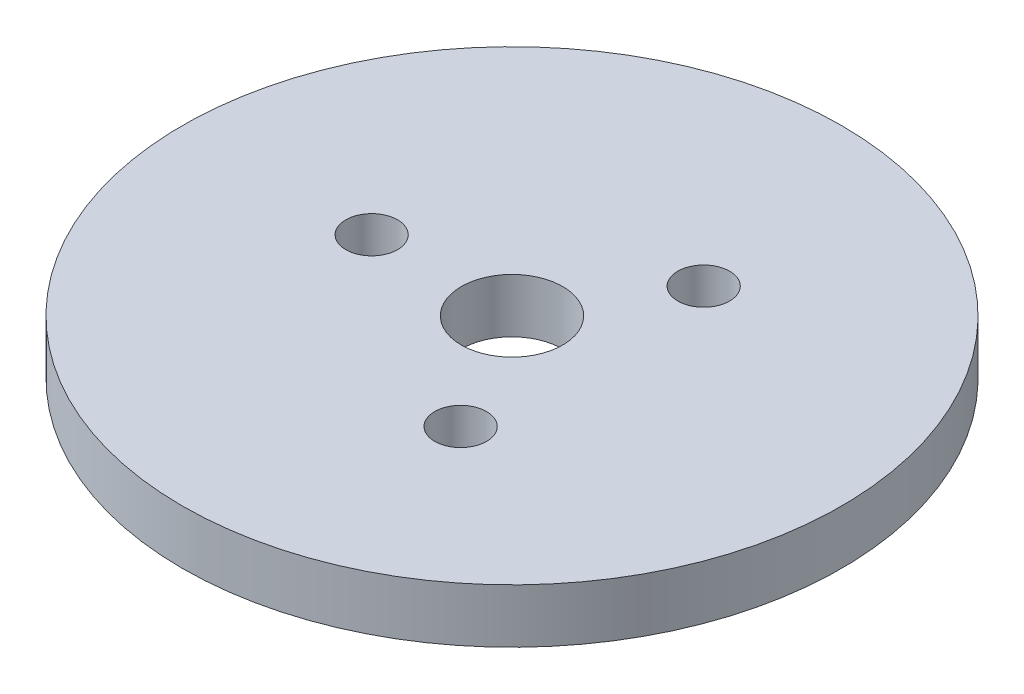
ISO-10303-21;
HEADER;
FILE_DESCRIPTION(('STEP AP214'),'2;1');
FILE_NAME('part.step','',(''),(''),'','','');
FILE_SCHEMA(('AUTOMOTIVE_DESIGN { 1 0 10303 214 1 1 1 1 }'));
ENDSEC;
DATA;
#1=APPLICATION_CONTEXT('core data for automotive mechanical design processes');
#2=APPLICATION_PROTOCOL_DEFINITION('international standard','automotive_design',2000,#1);
#3=PRODUCT_CONTEXT('',#1,'mechanical');
#4=PRODUCT('Part','Part','',(#3));
#5=PRODUCT_RELATED_PRODUCT_CATEGORY('part','',(#4));
#6=PRODUCT_DEFINITION_FORMATION('','',#4);
#7=PRODUCT_DEFINITION_CONTEXT('part definition',#1,'design');
#8=PRODUCT_DEFINITION('design','',#6,#7);
#9=PRODUCT_DEFINITION_SHAPE('','',#8);
#10=(LENGTH_UNIT() NAMED_UNIT(*) SI_UNIT(.MILLI.,.METRE.));
#11=(NAMED_UNIT(*) PLANE_ANGLE_UNIT() SI_UNIT($,.RADIAN.));
#12=(NAMED_UNIT(*) SI_UNIT($,.STERADIAN.) SOLID_ANGLE_UNIT());
#13=UNCERTAINTY_MEASURE_WITH_UNIT(LENGTH_MEASURE(1.E-05),#10,'distance_accuracy_value','');
#14=(GEOMETRIC_REPRESENTATION_CONTEXT(3) GLOBAL_UNCERTAINTY_ASSIGNED_CONTEXT((#13)) GLOBAL_UNIT_ASSIGNED_CONTEXT((#10,
#11,#12)) REPRESENTATION_CONTEXT('',''));
#15=CARTESIAN_POINT('',(0.,0.,0.));
#16=DIRECTION('',(0.,0.,1.));
#17=DIRECTION('',(1.,0.,0.));
#18=AXIS2_PLACEMENT_3D('',#15,#16,#17);
#19=CARTESIAN_POINT('',(0.,16.,0.));
#20=DIRECTION('',(0.,-1.,0.));
#21=DIRECTION('',(0.,0.,-1.));
#22=AXIS2_PLACEMENT_3D('',#19,#20,#21);
#23=CYLINDRICAL_SURFACE('',#22,97.5);
#24=CARTESIAN_POINT('',(0.,16.,0.));
#25=DIRECTION('',(0.,1.,0.));
#26=DIRECTION('',(0.,0.,1.));
#27=AXIS2_PLACEMENT_3D('',#24,#25,#26);
#28=CIRCLE('',#27,97.5);
#29=CARTESIAN_POINT('',(0.,16.,97.5));
#30=VERTEX_POINT('',#29);
#31=EDGE_CURVE('E10',#30,#30,#28,.T.);
#32=ORIENTED_EDGE('',*,*,#31,.F.);
#33=EDGE_LOOP('',(#32));
#34=FACE_BOUND('',#33,.T.);
#35=CARTESIAN_POINT('',(0.,0.,0.));
#36=DIRECTION('',(0.,1.,0.));
#37=DIRECTION('',(0.,0.,1.));
#38=AXIS2_PLACEMENT_3D('',#35,#36,#37);
#39=CIRCLE('',#38,97.5);
#40=CARTESIAN_POINT('',(0.,0.,97.5));
#41=VERTEX_POINT('',#40);
#42=EDGE_CURVE('E37',#41,#41,#39,.T.);
#43=ORIENTED_EDGE('',*,*,#42,.T.);
#44=EDGE_LOOP('',(#43));
#45=FACE_BOUND('',#44,.T.);
#46=ADVANCED_FACE('F40',(#34,#45),#23,.T.);
#47=CARTESIAN_POINT('',(0.,16.,0.));
#48=DIRECTION('',(0.,1.,0.));
#49=DIRECTION('',(0.,0.,1.));
#50=AXIS2_PLACEMENT_3D('',#47,#48,#49);
#51=PLANE('',#50);
#52=CARTESIAN_POINT('',(20.7603443131049,16.,35.9579711329209));
#53=DIRECTION('',(0.,1.,0.));
#54=DIRECTION('',(0.866025403784436,0.,-0.500000000000004));
#55=AXIS2_PLACEMENT_3D('',#52,#53,#54);
#56=CIRCLE('',#55,7.66329061318594);
#57=CARTESIAN_POINT('',(27.3969486607068,16.,32.1263258263279));
#58=VERTEX_POINT('',#57);
#59=EDGE_CURVE('E70',#58,#58,#56,.T.);
#60=ORIENTED_EDGE('',*,*,#59,.F.);
#61=EDGE_LOOP('',(#60));
#62=FACE_BOUND('',#61,.T.);
#63=CARTESIAN_POINT('',(20.7603443131044,16.,-35.9579711329212));
#64=DIRECTION('',(0.,1.,0.));
#65=DIRECTION('',(-0.866025403784443,0.,-0.499999999999992));
#66=AXIS2_PLACEMENT_3D('',#63,#64,#65);
#67=CIRCLE('',#66,7.66329061318594);
#68=CARTESIAN_POINT('',(14.1237399655025,16.,-39.7896164395141));
#69=VERTEX_POINT('',#68);
#70=EDGE_CURVE('E61',#69,#69,#67,.T.);
#71=ORIENTED_EDGE('',*,*,#70,.F.);
#72=EDGE_LOOP('',(#71));
#73=FACE_BOUND('',#72,.T.);
#74=CARTESIAN_POINT('',(-41.5206886262095,16.,0.));
#75=DIRECTION('',(0.,1.,0.));
#76=DIRECTION('',(0.,0.,1.));
#77=AXIS2_PLACEMENT_3D('',#74,#75,#76);
#78=CIRCLE('',#77,7.66329061318594);
#79=CARTESIAN_POINT('',(-41.5206886262095,16.,7.66329061318594));
#80=VERTEX_POINT('',#79);
#81=EDGE_CURVE('E54',#80,#80,#78,.T.);
#82=ORIENTED_EDGE('',*,*,#81,.F.);
#83=EDGE_LOOP('',(#82));
#84=FACE_BOUND('',#83,.T.);
#85=CARTESIAN_POINT('',(0.,16.,0.));
#86=DIRECTION('',(0.,1.,0.));
#87=DIRECTION('',(0.,0.,1.));
#88=AXIS2_PLACEMENT_3D('',#85,#86,#87);
#89=CIRCLE('',#88,15.);
#90=CARTESIAN_POINT('',(0.,16.,15.));
#91=VERTEX_POINT('',#90);
#92=EDGE_CURVE('E50',#91,#91,#89,.T.);
#93=ORIENTED_EDGE('',*,*,#92,.F.);
#94=EDGE_LOOP('',(#93));
#95=FACE_BOUND('',#94,.T.);
#96=ORIENTED_EDGE('',*,*,#31,.T.);
#97=EDGE_LOOP('',(#96));
#98=FACE_BOUND('',#97,.T.);
#99=ADVANCED_FACE('F85',(#62,#73,#84,#95,#98),#51,.T.);
#100=CARTESIAN_POINT('',(0.,0.,0.));
#101=DIRECTION('',(0.,1.,0.));
#102=DIRECTION('',(0.,0.,1.));
#103=AXIS2_PLACEMENT_3D('',#100,#101,#102);
#104=PLANE('',#103);
#105=CARTESIAN_POINT('',(0.,0.,0.));
#106=DIRECTION('',(0.,1.,0.));
#107=DIRECTION('',(0.,0.,1.));
#108=AXIS2_PLACEMENT_3D('',#105,#106,#107);
#109=CIRCLE('',#108,15.);
#110=CARTESIAN_POINT('',(0.,0.,15.));
#111=VERTEX_POINT('',#110);
#112=EDGE_CURVE('E47',#111,#111,#109,.T.);
#113=ORIENTED_EDGE('',*,*,#112,.T.);
#114=EDGE_LOOP('',(#113));
#115=FACE_BOUND('',#114,.T.);
#116=ORIENTED_EDGE('',*,*,#42,.F.);
#117=EDGE_LOOP('',(#116));
#118=FACE_BOUND('',#117,.T.);
#119=ADVANCED_FACE('F84',(#115,#118),#104,.F.);
#120=CARTESIAN_POINT('',(0.,16.,0.));
#121=DIRECTION('',(0.,-1.,0.));
#122=DIRECTION('',(0.,0.,-1.));
#123=AXIS2_PLACEMENT_3D('',#120,#121,#122);
#124=CYLINDRICAL_SURFACE('',#123,15.);
#125=ORIENTED_EDGE('',*,*,#92,.T.);
#126=EDGE_LOOP('',(#125));
#127=FACE_BOUND('',#126,.T.);
#128=ORIENTED_EDGE('',*,*,#112,.F.);
#129=EDGE_LOOP('',(#128));
#130=FACE_BOUND('',#129,.T.);
#131=ADVANCED_FACE('F91',(#127,#130),#124,.F.);
#132=CARTESIAN_POINT('',(-41.5206886262095,4.66800810287036,0.));
#133=DIRECTION('',(0.,1.,0.));
#134=DIRECTION('',(0.,0.,1.));
#135=AXIS2_PLACEMENT_3D('',#132,#133,#134);
#136=CYLINDRICAL_SURFACE('',#135,7.66329061318594);
#137=CARTESIAN_POINT('',(-41.5206886262095,4.66800810287036,0.));
#138=DIRECTION('',(0.,1.,0.));
#139=DIRECTION('',(0.,0.,1.));
#140=AXIS2_PLACEMENT_3D('',#137,#138,#139);
#141=CIRCLE('',#140,7.66329061318594);
#142=CARTESIAN_POINT('',(-41.5206886262095,4.66800810287036,7.66329061318594));
#143=VERTEX_POINT('',#142);
#144=EDGE_CURVE('E55',#143,#143,#141,.T.);
#145=ORIENTED_EDGE('',*,*,#144,.F.);
#146=EDGE_LOOP('',(#145));
#147=FACE_BOUND('',#146,.T.);
#148=ORIENTED_EDGE('',*,*,#81,.T.);
#149=EDGE_LOOP('',(#148));
#150=FACE_BOUND('',#149,.T.);
#151=ADVANCED_FACE('F96',(#147,#150),#136,.F.);
#152=CARTESIAN_POINT('',(-41.5206886262095,4.66800810287036,0.));
#153=DIRECTION('',(0.,1.,0.));
#154=DIRECTION('',(0.,0.,1.));
#155=AXIS2_PLACEMENT_3D('',#152,#153,#154);
#156=PLANE('',#155);
#157=ORIENTED_EDGE('',*,*,#144,.T.);
#158=EDGE_LOOP('',(#157));
#159=FACE_BOUND('',#158,.T.);
#160=ADVANCED_FACE('F127',(#159),#156,.T.);
#161=CARTESIAN_POINT('',(20.7603443131044,4.66800810287036,-35.9579711329212));
#162=DIRECTION('',(0.,1.,0.));
#163=DIRECTION('',(0.,0.,1.));
#164=AXIS2_PLACEMENT_3D('',#161,#162,#163);
#165=CYLINDRICAL_SURFACE('',#164,7.66329061318594);
#166=CARTESIAN_POINT('',(20.7603443131044,4.66800810287036,-35.9579711329212));
#167=DIRECTION('',(0.,1.,0.));
#168=DIRECTION('',(-0.866025403784443,0.,-0.499999999999992));
#169=AXIS2_PLACEMENT_3D('',#166,#167,#168);
#170=CIRCLE('',#169,7.66329061318594);
#171=CARTESIAN_POINT('',(14.1237399655025,4.66800810287036,-39.7896164395141));
#172=VERTEX_POINT('',#171);
#173=EDGE_CURVE('E63',#172,#172,#170,.T.);
#174=ORIENTED_EDGE('',*,*,#173,.F.);
#175=EDGE_LOOP('',(#174));
#176=FACE_BOUND('',#175,.T.);
#177=ORIENTED_EDGE('',*,*,#70,.T.);
#178=EDGE_LOOP('',(#177));
#179=FACE_BOUND('',#178,.T.);
#180=ADVANCED_FACE('F133',(#176,#179),#165,.F.);
#181=CARTESIAN_POINT('',(20.7603443131044,4.66800810287036,-35.9579711329212));
#182=DIRECTION('',(0.,1.,0.));
#183=DIRECTION('',(-0.866025403784443,0.,-0.499999999999992));
#184=AXIS2_PLACEMENT_3D('',#181,#182,#183);
#185=PLANE('',#184);
#186=ORIENTED_EDGE('',*,*,#173,.T.);
#187=EDGE_LOOP('',(#186));
#188=FACE_BOUND('',#187,.T.);
#189=ADVANCED_FACE('F77',(#188),#185,.T.);
#190=CARTESIAN_POINT('',(20.7603443131049,4.66800810287036,35.9579711329209));
#191=DIRECTION('',(0.,1.,0.));
#192=DIRECTION('',(0.,0.,1.));
#193=AXIS2_PLACEMENT_3D('',#190,#191,#192);
#194=CYLINDRICAL_SURFACE('',#193,7.66329061318594);
#195=CARTESIAN_POINT('',(20.7603443131049,4.66800810287036,35.9579711329209));
#196=DIRECTION('',(0.,1.,0.));
#197=DIRECTION('',(0.866025403784436,0.,-0.500000000000004));
#198=AXIS2_PLACEMENT_3D('',#195,#196,#197);
#199=CIRCLE('',#198,7.66329061318594);
#200=CARTESIAN_POINT('',(27.3969486607068,4.66800810287036,32.1263258263279));
#201=VERTEX_POINT('',#200);
#202=EDGE_CURVE('E59',#201,#201,#199,.T.);
#203=ORIENTED_EDGE('',*,*,#202,.F.);
#204=EDGE_LOOP('',(#203));
#205=FACE_BOUND('',#204,.T.);
#206=ORIENTED_EDGE('',*,*,#59,.T.);
#207=EDGE_LOOP('',(#206));
#208=FACE_BOUND('',#207,.T.);
#209=ADVANCED_FACE('F73',(#205,#208),#194,.F.);
#210=CARTESIAN_POINT('',(20.7603443131049,4.66800810287036,35.9579711329209));
#211=DIRECTION('',(0.,1.,0.));
#212=DIRECTION('',(0.866025403784436,0.,-0.500000000000004));
#213=AXIS2_PLACEMENT_3D('',#210,#211,#212);
#214=PLANE('',#213);
#215=ORIENTED_EDGE('',*,*,#202,.T.);
#216=EDGE_LOOP('',(#215));
#217=FACE_BOUND('',#216,.T.);
#218=ADVANCED_FACE('F71',(#217),#214,.T.);
#219=CLOSED_SHELL('',(#46,#99,#119,#131,#151,#160,#180,#189,#209,#218));
#220=MANIFOLD_SOLID_BREP('B2',#219);
#221=ADVANCED_BREP_SHAPE_REPRESENTATION('',(#18,#220),#14);
#222=SHAPE_DEFINITION_REPRESENTATION(#9,#221);
ENDSEC;
END-ISO-10303-21;
